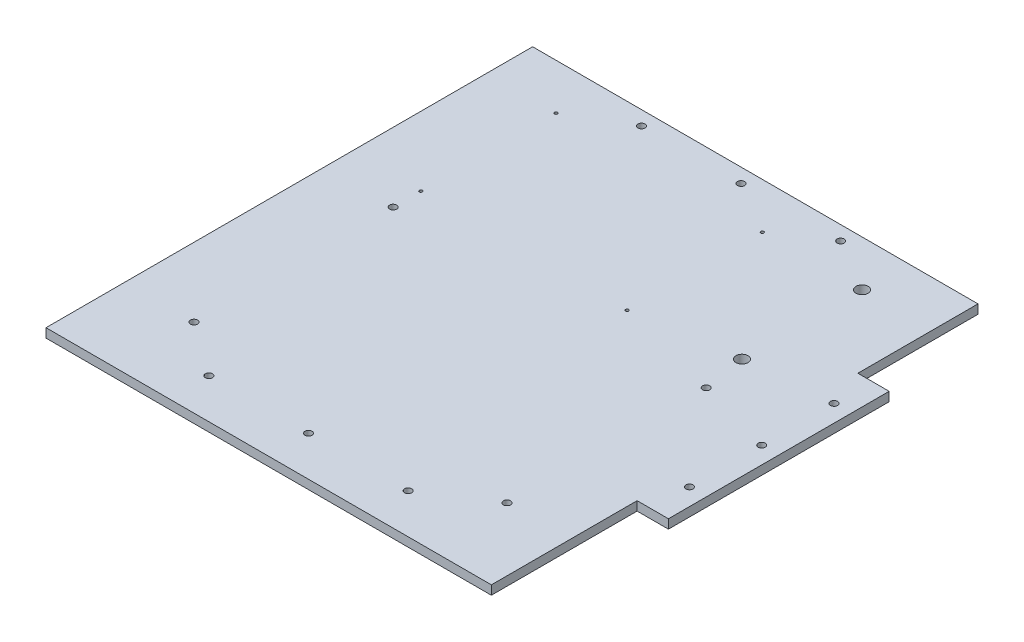
ISO-10303-21;
HEADER;
FILE_DESCRIPTION(('STEP AP214'),'2;1');
FILE_NAME('part.step','',(''),(''),'','','');
FILE_SCHEMA(('AUTOMOTIVE_DESIGN { 1 0 10303 214 1 1 1 1 }'));
ENDSEC;
DATA;
#1=APPLICATION_CONTEXT('core data for automotive mechanical design processes');
#2=APPLICATION_PROTOCOL_DEFINITION('international standard','automotive_design',2000,#1);
#3=PRODUCT_CONTEXT('',#1,'mechanical');
#4=PRODUCT('Part','Part','',(#3));
#5=PRODUCT_RELATED_PRODUCT_CATEGORY('part','',(#4));
#6=PRODUCT_DEFINITION_FORMATION('','',#4);
#7=PRODUCT_DEFINITION_CONTEXT('part definition',#1,'design');
#8=PRODUCT_DEFINITION('design','',#6,#7);
#9=PRODUCT_DEFINITION_SHAPE('','',#8);
#10=(LENGTH_UNIT() NAMED_UNIT(*) SI_UNIT(.MILLI.,.METRE.));
#11=(NAMED_UNIT(*) PLANE_ANGLE_UNIT() SI_UNIT($,.RADIAN.));
#12=(NAMED_UNIT(*) SI_UNIT($,.STERADIAN.) SOLID_ANGLE_UNIT());
#13=UNCERTAINTY_MEASURE_WITH_UNIT(LENGTH_MEASURE(1.E-05),#10,'distance_accuracy_value','');
#14=(GEOMETRIC_REPRESENTATION_CONTEXT(3) GLOBAL_UNCERTAINTY_ASSIGNED_CONTEXT((#13)) GLOBAL_UNIT_ASSIGNED_CONTEXT((#10,
#11,#12)) REPRESENTATION_CONTEXT('',''));
#15=CARTESIAN_POINT('',(0.,0.,0.));
#16=DIRECTION('',(0.,0.,1.));
#17=DIRECTION('',(1.,0.,0.));
#18=AXIS2_PLACEMENT_3D('',#15,#16,#17);
#19=CARTESIAN_POINT('',(156.499999999998,-6.35,171.));
#20=DIRECTION('',(1.,0.,0.));
#21=DIRECTION('',(0.,0.,-1.));
#22=AXIS2_PLACEMENT_3D('',#19,#20,#21);
#23=PLANE('',#22);
#24=DIRECTION('',(0.,0.,-1.));
#25=VECTOR('',#24,1.);
#26=CARTESIAN_POINT('',(156.499999999998,-6.35,171.));
#27=LINE('',#26,#25);
#28=CARTESIAN_POINT('',(156.499999999998,-6.35,171.));
#29=VERTEX_POINT('',#28);
#30=CARTESIAN_POINT('',(156.499999999998,-6.35,68.570201764885));
#31=VERTEX_POINT('',#30);
#32=EDGE_CURVE('E148',#29,#31,#27,.T.);
#33=ORIENTED_EDGE('',*,*,#32,.T.);
#34=DIRECTION('',(0.,1.,0.));
#35=VECTOR('',#34,1.);
#36=CARTESIAN_POINT('',(156.499999999998,-6.35,68.570201764885));
#37=LINE('',#36,#35);
#38=CARTESIAN_POINT('',(156.499999999998,0.,68.570201764885));
#39=VERTEX_POINT('',#38);
#40=EDGE_CURVE('E130',#31,#39,#37,.T.);
#41=ORIENTED_EDGE('',*,*,#40,.T.);
#42=DIRECTION('',(0.,0.,-1.));
#43=VECTOR('',#42,1.);
#44=CARTESIAN_POINT('',(156.499999999998,0.,171.));
#45=LINE('',#44,#43);
#46=CARTESIAN_POINT('',(156.499999999998,0.,171.));
#47=VERTEX_POINT('',#46);
#48=EDGE_CURVE('E158',#47,#39,#45,.T.);
#49=ORIENTED_EDGE('',*,*,#48,.F.);
#50=DIRECTION('',(0.,1.,0.));
#51=VECTOR('',#50,1.);
#52=CARTESIAN_POINT('',(156.499999999998,-6.35,171.));
#53=LINE('',#52,#51);
#54=EDGE_CURVE('E11',#29,#47,#53,.T.);
#55=ORIENTED_EDGE('',*,*,#54,.F.);
#56=EDGE_LOOP('',(#33,#41,#49,#55));
#57=FACE_BOUND('',#56,.T.);
#58=ADVANCED_FACE('F37',(#57),#23,.T.);
#59=DIRECTION('',(0.,1.,0.));
#60=VECTOR('',#59,1.);
#61=CARTESIAN_POINT('',(156.499999999998,-6.35,-86.570201764878));
#62=LINE('',#61,#60);
#63=CARTESIAN_POINT('',(156.499999999998,-6.35,-86.570201764878));
#64=VERTEX_POINT('',#63);
#65=CARTESIAN_POINT('',(156.499999999998,0.,-86.570201764878));
#66=VERTEX_POINT('',#65);
#67=EDGE_CURVE('E145',#64,#66,#62,.T.);
#68=ORIENTED_EDGE('',*,*,#67,.F.);
#69=CARTESIAN_POINT('',(156.499999999998,-6.35,-171.));
#70=VERTEX_POINT('',#69);
#71=EDGE_CURVE('E88',#64,#70,#27,.T.);
#72=ORIENTED_EDGE('',*,*,#71,.T.);
#73=DIRECTION('',(0.,1.,0.));
#74=VECTOR('',#73,1.);
#75=CARTESIAN_POINT('',(156.499999999998,-6.35,-171.));
#76=LINE('',#75,#74);
#77=CARTESIAN_POINT('',(156.499999999998,0.,-171.));
#78=VERTEX_POINT('',#77);
#79=EDGE_CURVE('E41',#70,#78,#76,.T.);
#80=ORIENTED_EDGE('',*,*,#79,.T.);
#81=EDGE_CURVE('E144',#66,#78,#45,.T.);
#82=ORIENTED_EDGE('',*,*,#81,.F.);
#83=EDGE_LOOP('',(#68,#72,#80,#82));
#84=FACE_BOUND('',#83,.T.);
#85=ADVANCED_FACE('F39',(#84),#23,.T.);
#86=CARTESIAN_POINT('',(-156.500000000002,-6.35,171.));
#87=DIRECTION('',(0.,0.,1.));
#88=DIRECTION('',(1.,0.,0.));
#89=AXIS2_PLACEMENT_3D('',#86,#87,#88);
#90=PLANE('',#89);
#91=DIRECTION('',(1.,0.,0.));
#92=VECTOR('',#91,1.);
#93=CARTESIAN_POINT('',(-156.500000000002,0.,171.));
#94=LINE('',#93,#92);
#95=CARTESIAN_POINT('',(-156.500000000002,0.,171.));
#96=VERTEX_POINT('',#95);
#97=EDGE_CURVE('E167',#96,#47,#94,.T.);
#98=ORIENTED_EDGE('',*,*,#97,.F.);
#99=DIRECTION('',(0.,1.,0.));
#100=VECTOR('',#99,1.);
#101=CARTESIAN_POINT('',(-156.500000000002,-6.35,171.));
#102=LINE('',#101,#100);
#103=CARTESIAN_POINT('',(-156.500000000002,-6.35,171.));
#104=VERTEX_POINT('',#103);
#105=EDGE_CURVE('E46',#104,#96,#102,.T.);
#106=ORIENTED_EDGE('',*,*,#105,.F.);
#107=DIRECTION('',(1.,0.,0.));
#108=VECTOR('',#107,1.);
#109=CARTESIAN_POINT('',(-156.500000000002,-6.35,171.));
#110=LINE('',#109,#108);
#111=EDGE_CURVE('E156',#104,#29,#110,.T.);
#112=ORIENTED_EDGE('',*,*,#111,.T.);
#113=ORIENTED_EDGE('',*,*,#54,.T.);
#114=EDGE_LOOP('',(#98,#106,#112,#113));
#115=FACE_BOUND('',#114,.T.);
#116=ADVANCED_FACE('F187',(#115),#90,.T.);
#117=CARTESIAN_POINT('',(-156.500000000002,-6.35,171.));
#118=DIRECTION('',(-1.,0.,0.));
#119=DIRECTION('',(0.,0.,1.));
#120=AXIS2_PLACEMENT_3D('',#117,#118,#119);
#121=PLANE('',#120);
#122=DIRECTION('',(0.,0.,1.));
#123=VECTOR('',#122,1.);
#124=CARTESIAN_POINT('',(-156.500000000002,0.,171.));
#125=LINE('',#124,#123);
#126=CARTESIAN_POINT('',(-156.500000000002,0.,-171.));
#127=VERTEX_POINT('',#126);
#128=EDGE_CURVE('E164',#127,#96,#125,.T.);
#129=ORIENTED_EDGE('',*,*,#128,.F.);
#130=DIRECTION('',(0.,1.,0.));
#131=VECTOR('',#130,1.);
#132=CARTESIAN_POINT('',(-156.500000000002,-6.35,-171.));
#133=LINE('',#132,#131);
#134=CARTESIAN_POINT('',(-156.500000000002,-6.35,-171.));
#135=VERTEX_POINT('',#134);
#136=EDGE_CURVE('E170',#135,#127,#133,.T.);
#137=ORIENTED_EDGE('',*,*,#136,.F.);
#138=DIRECTION('',(0.,0.,1.));
#139=VECTOR('',#138,1.);
#140=CARTESIAN_POINT('',(-156.500000000002,-6.35,171.));
#141=LINE('',#140,#139);
#142=EDGE_CURVE('E153',#135,#104,#141,.T.);
#143=ORIENTED_EDGE('',*,*,#142,.T.);
#144=ORIENTED_EDGE('',*,*,#105,.T.);
#145=EDGE_LOOP('',(#129,#137,#143,#144));
#146=FACE_BOUND('',#145,.T.);
#147=ADVANCED_FACE('F186',(#146),#121,.T.);
#148=CARTESIAN_POINT('',(-156.500000000002,-6.35,-171.));
#149=DIRECTION('',(0.,0.,-1.));
#150=DIRECTION('',(-1.,0.,0.));
#151=AXIS2_PLACEMENT_3D('',#148,#149,#150);
#152=PLANE('',#151);
#153=DIRECTION('',(-1.,0.,0.));
#154=VECTOR('',#153,1.);
#155=CARTESIAN_POINT('',(-156.500000000002,0.,-171.));
#156=LINE('',#155,#154);
#157=EDGE_CURVE('E161',#78,#127,#156,.T.);
#158=ORIENTED_EDGE('',*,*,#157,.F.);
#159=ORIENTED_EDGE('',*,*,#79,.F.);
#160=DIRECTION('',(-1.,0.,0.));
#161=VECTOR('',#160,1.);
#162=CARTESIAN_POINT('',(-156.500000000002,-6.35,-171.));
#163=LINE('',#162,#161);
#164=EDGE_CURVE('E150',#70,#135,#163,.T.);
#165=ORIENTED_EDGE('',*,*,#164,.T.);
#166=ORIENTED_EDGE('',*,*,#136,.T.);
#167=EDGE_LOOP('',(#158,#159,#165,#166));
#168=FACE_BOUND('',#167,.T.);
#169=ADVANCED_FACE('F176',(#168),#152,.T.);
#170=CARTESIAN_POINT('',(0.,-6.35,0.));
#171=DIRECTION('',(0.,-1.,0.));
#172=DIRECTION('',(0.,0.,-1.));
#173=AXIS2_PLACEMENT_3D('',#170,#171,#172);
#174=PLANE('',#173);
#175=CARTESIAN_POINT('',(107.20488213636,-6.35,-54.4253878544765));
#176=DIRECTION('',(0.,1.,0.));
#177=DIRECTION('',(0.,0.,1.));
#178=AXIS2_PLACEMENT_3D('',#175,#176,#177);
#179=CIRCLE('',#178,4.25000000000002);
#180=CARTESIAN_POINT('',(107.20488213636,-6.35,-50.1753878544765));
#181=VERTEX_POINT('',#180);
#182=EDGE_CURVE('E326',#181,#181,#179,.T.);
#183=ORIENTED_EDGE('',*,*,#182,.T.);
#184=EDGE_LOOP('',(#183));
#185=FACE_BOUND('',#184,.T.);
#186=CARTESIAN_POINT('',(-107.911484213623,-6.35,115.605535397188));
#187=DIRECTION('',(0.,1.,0.));
#188=DIRECTION('',(0.,0.,-1.));
#189=AXIS2_PLACEMENT_3D('',#186,#187,#188);
#190=CIRCLE('',#189,2.50000000000005);
#191=CARTESIAN_POINT('',(-107.911484213623,-6.35,113.105535397188));
#192=VERTEX_POINT('',#191);
#193=EDGE_CURVE('E316',#192,#192,#190,.T.);
#194=ORIENTED_EDGE('',*,*,#193,.T.);
#195=EDGE_LOOP('',(#194));
#196=FACE_BOUND('',#195,.T.);
#197=CARTESIAN_POINT('',(-107.911484213622,-6.35,-24.3944646028125));
#198=DIRECTION('',(0.,1.,0.));
#199=DIRECTION('',(0.,0.,-1.));
#200=AXIS2_PLACEMENT_3D('',#197,#198,#199);
#201=CIRCLE('',#200,2.50000000000005);
#202=CARTESIAN_POINT('',(-107.911484213622,-6.35,-26.8944646028126));
#203=VERTEX_POINT('',#202);
#204=EDGE_CURVE('E317',#203,#203,#201,.T.);
#205=ORIENTED_EDGE('',*,*,#204,.T.);
#206=EDGE_LOOP('',(#205));
#207=FACE_BOUND('',#206,.T.);
#208=CARTESIAN_POINT('',(112.088515786378,-6.35,-24.394464602811));
#209=DIRECTION('',(0.,1.,0.));
#210=DIRECTION('',(0.,0.,-1.));
#211=AXIS2_PLACEMENT_3D('',#208,#209,#210);
#212=CIRCLE('',#211,2.49999999999997);
#213=CARTESIAN_POINT('',(112.088515786378,-6.35,-26.8944646028109));
#214=VERTEX_POINT('',#213);
#215=EDGE_CURVE('E306',#214,#214,#212,.T.);
#216=ORIENTED_EDGE('',*,*,#215,.T.);
#217=EDGE_LOOP('',(#216));
#218=FACE_BOUND('',#217,.T.);
#219=CARTESIAN_POINT('',(37.0885157863766,-6.35,-138.829587854477));
#220=DIRECTION('',(0.,1.,0.));
#221=DIRECTION('',(0.,0.,1.));
#222=AXIS2_PLACEMENT_3D('',#219,#220,#221);
#223=CIRCLE('',#222,1.04999999999979);
#224=CARTESIAN_POINT('',(37.0885157863766,-6.35,-137.779587854477));
#225=VERTEX_POINT('',#224);
#226=EDGE_CURVE('E349',#225,#225,#223,.T.);
#227=ORIENTED_EDGE('',*,*,#226,.T.);
#228=EDGE_LOOP('',(#227));
#229=FACE_BOUND('',#228,.T.);
#230=CARTESIAN_POINT('',(37.0885157863766,-6.35,-43.8295878544765));
#231=DIRECTION('',(0.,1.,0.));
#232=DIRECTION('',(0.,0.,1.));
#233=AXIS2_PLACEMENT_3D('',#230,#231,#232);
#234=CIRCLE('',#233,1.05000000000002);
#235=CARTESIAN_POINT('',(37.0885157863766,-6.35,-42.7795878544765));
#236=VERTEX_POINT('',#235);
#237=EDGE_CURVE('E336',#236,#236,#234,.T.);
#238=ORIENTED_EDGE('',*,*,#237,.T.);
#239=EDGE_LOOP('',(#238));
#240=FACE_BOUND('',#239,.T.);
#241=CARTESIAN_POINT('',(-107.911484213623,-6.35,-43.8295878544765));
#242=DIRECTION('',(0.,1.,0.));
#243=DIRECTION('',(0.,0.,1.));
#244=AXIS2_PLACEMENT_3D('',#241,#242,#243);
#245=CIRCLE('',#244,1.04999999999999);
#246=CARTESIAN_POINT('',(-107.911484213623,-6.35,-42.7795878544765));
#247=VERTEX_POINT('',#246);
#248=EDGE_CURVE('E337',#247,#247,#245,.T.);
#249=ORIENTED_EDGE('',*,*,#248,.T.);
#250=EDGE_LOOP('',(#249));
#251=FACE_BOUND('',#250,.T.);
#252=CARTESIAN_POINT('',(107.20488213636,-6.35,-138.829587854477));
#253=DIRECTION('',(0.,1.,0.));
#254=DIRECTION('',(0.,0.,-1.));
#255=AXIS2_PLACEMENT_3D('',#252,#253,#254);
#256=CIRCLE('',#255,4.25000000000001);
#257=CARTESIAN_POINT('',(107.20488213636,-6.35,-143.079587854477));
#258=VERTEX_POINT('',#257);
#259=EDGE_CURVE('E325',#258,#258,#256,.T.);
#260=ORIENTED_EDGE('',*,*,#259,.T.);
#261=EDGE_LOOP('',(#260));
#262=FACE_BOUND('',#261,.T.);
#263=CARTESIAN_POINT('',(112.088515786377,-6.35,115.60553539719));
#264=DIRECTION('',(0.,1.,0.));
#265=DIRECTION('',(0.,0.,-1.));
#266=AXIS2_PLACEMENT_3D('',#263,#264,#265);
#267=CIRCLE('',#266,2.49999999999995);
#268=CARTESIAN_POINT('',(112.088515786377,-6.35,113.10553539719));
#269=VERTEX_POINT('',#268);
#270=EDGE_CURVE('E301',#269,#269,#267,.T.);
#271=ORIENTED_EDGE('',*,*,#270,.T.);
#272=EDGE_LOOP('',(#271));
#273=FACE_BOUND('',#272,.T.);
#274=CARTESIAN_POINT('',(-107.911484213623,-6.35,-138.829587854477));
#275=DIRECTION('',(0.,1.,0.));
#276=DIRECTION('',(0.,0.,1.));
#277=AXIS2_PLACEMENT_3D('',#274,#275,#276);
#278=CIRCLE('',#277,1.05000000000002);
#279=CARTESIAN_POINT('',(-107.911484213623,-6.35,-137.779587854476));
#280=VERTEX_POINT('',#279);
#281=EDGE_CURVE('E357',#280,#280,#278,.T.);
#282=ORIENTED_EDGE('',*,*,#281,.T.);
#283=EDGE_LOOP('',(#282));
#284=FACE_BOUND('',#283,.T.);
#285=CARTESIAN_POINT('',(-70.,-6.35,143.000000000004));
#286=DIRECTION('',(0.,1.,0.));
#287=DIRECTION('',(0.,0.,1.));
#288=AXIS2_PLACEMENT_3D('',#285,#286,#287);
#289=CIRCLE('',#288,2.5);
#290=CARTESIAN_POINT('',(-70.,-6.35,145.500000000004));
#291=VERTEX_POINT('',#290);
#292=EDGE_CURVE('E373',#291,#291,#289,.T.);
#293=ORIENTED_EDGE('',*,*,#292,.T.);
#294=EDGE_LOOP('',(#293));
#295=FACE_BOUND('',#294,.T.);
#296=CARTESIAN_POINT('',(70.,-6.35,143.000000000004));
#297=DIRECTION('',(0.,1.,0.));
#298=DIRECTION('',(0.,0.,-1.));
#299=AXIS2_PLACEMENT_3D('',#296,#297,#298);
#300=CIRCLE('',#299,2.5);
#301=CARTESIAN_POINT('',(70.,-6.35,140.500000000004));
#302=VERTEX_POINT('',#301);
#303=EDGE_CURVE('E379',#302,#302,#300,.T.);
#304=ORIENTED_EDGE('',*,*,#303,.T.);
#305=EDGE_LOOP('',(#304));
#306=FACE_BOUND('',#305,.T.);
#307=CARTESIAN_POINT('',(-70.,-6.35,-160.999999999996));
#308=DIRECTION('',(0.,1.,0.));
#309=DIRECTION('',(0.,0.,-1.));
#310=AXIS2_PLACEMENT_3D('',#307,#308,#309);
#311=CIRCLE('',#310,2.50000000000001);
#312=CARTESIAN_POINT('',(-70.,-6.35,-163.499999999996));
#313=VERTEX_POINT('',#312);
#314=EDGE_CURVE('E385',#313,#313,#311,.T.);
#315=ORIENTED_EDGE('',*,*,#314,.T.);
#316=EDGE_LOOP('',(#315));
#317=FACE_BOUND('',#316,.T.);
#318=CARTESIAN_POINT('',(0.,-6.35,-160.999999999996));
#319=DIRECTION('',(0.,1.,0.));
#320=DIRECTION('',(0.,0.,-1.));
#321=AXIS2_PLACEMENT_3D('',#318,#319,#320);
#322=CIRCLE('',#321,2.49999999999999);
#323=CARTESIAN_POINT('',(0.,-6.35,-163.499999999996));
#324=VERTEX_POINT('',#323);
#325=EDGE_CURVE('E366',#324,#324,#322,.T.);
#326=ORIENTED_EDGE('',*,*,#325,.T.);
#327=EDGE_LOOP('',(#326));
#328=FACE_BOUND('',#327,.T.);
#329=CARTESIAN_POINT('',(70.,-6.35,-160.999999999996));
#330=DIRECTION('',(0.,1.,0.));
#331=DIRECTION('',(0.,0.,1.));
#332=AXIS2_PLACEMENT_3D('',#329,#330,#331);
#333=CIRCLE('',#332,2.50000000000001);
#334=CARTESIAN_POINT('',(70.,-6.35,-158.499999999996));
#335=VERTEX_POINT('',#334);
#336=EDGE_CURVE('E360',#335,#335,#333,.T.);
#337=ORIENTED_EDGE('',*,*,#336,.T.);
#338=EDGE_LOOP('',(#337));
#339=FACE_BOUND('',#338,.T.);
#340=CARTESIAN_POINT('',(0.,-6.35,143.000000000004));
#341=DIRECTION('',(0.,1.,0.));
#342=DIRECTION('',(0.,0.,1.));
#343=AXIS2_PLACEMENT_3D('',#340,#341,#342);
#344=CIRCLE('',#343,2.5);
#345=CARTESIAN_POINT('',(0.,-6.35,145.500000000004));
#346=VERTEX_POINT('',#345);
#347=EDGE_CURVE('E393',#346,#346,#344,.T.);
#348=ORIENTED_EDGE('',*,*,#347,.T.);
#349=EDGE_LOOP('',(#348));
#350=FACE_BOUND('',#349,.T.);
#351=ORIENTED_EDGE('',*,*,#32,.F.);
#352=ORIENTED_EDGE('',*,*,#111,.F.);
#353=ORIENTED_EDGE('',*,*,#142,.F.);
#354=ORIENTED_EDGE('',*,*,#164,.F.);
#355=ORIENTED_EDGE('',*,*,#71,.F.);
#356=DIRECTION('',(-1.,0.,0.));
#357=VECTOR('',#356,1.);
#358=CARTESIAN_POINT('',(178.499999999998,-6.35,-86.570201764878));
#359=LINE('',#358,#357);
#360=CARTESIAN_POINT('',(178.499999999998,-6.35,-86.570201764878));
#361=VERTEX_POINT('',#360);
#362=EDGE_CURVE('E120',#361,#64,#359,.T.);
#363=ORIENTED_EDGE('',*,*,#362,.F.);
#364=DIRECTION('',(0.,0.,-1.));
#365=VECTOR('',#364,1.);
#366=CARTESIAN_POINT('',(178.499999999998,-6.35,68.570201764885));
#367=LINE('',#366,#365);
#368=CARTESIAN_POINT('',(178.499999999998,-6.35,68.570201764885));
#369=VERTEX_POINT('',#368);
#370=EDGE_CURVE('E115',#369,#361,#367,.T.);
#371=ORIENTED_EDGE('',*,*,#370,.F.);
#372=DIRECTION('',(1.,0.,0.));
#373=VECTOR('',#372,1.);
#374=CARTESIAN_POINT('',(156.499999999998,-6.35,68.570201764885));
#375=LINE('',#374,#373);
#376=EDGE_CURVE('E127',#31,#369,#375,.T.);
#377=ORIENTED_EDGE('',*,*,#376,.F.);
#378=EDGE_LOOP('',(#351,#352,#353,#354,#355,#363,#371,#377));
#379=FACE_BOUND('',#378,.T.);
#380=CARTESIAN_POINT('',(166.499999999998,-6.35,-59.7999999999965));
#381=DIRECTION('',(0.,1.,0.));
#382=DIRECTION('',(0.,0.,-1.));
#383=AXIS2_PLACEMENT_3D('',#380,#381,#382);
#384=CIRCLE('',#383,2.5);
#385=CARTESIAN_POINT('',(166.499999999998,-6.35,-62.2999999999965));
#386=VERTEX_POINT('',#385);
#387=EDGE_CURVE('E399',#386,#386,#384,.T.);
#388=ORIENTED_EDGE('',*,*,#387,.T.);
#389=EDGE_LOOP('',(#388));
#390=FACE_BOUND('',#389,.T.);
#391=CARTESIAN_POINT('',(166.499999999998,-6.35,41.8000000000035));
#392=DIRECTION('',(0.,1.,0.));
#393=DIRECTION('',(0.,0.,1.));
#394=AXIS2_PLACEMENT_3D('',#391,#392,#393);
#395=CIRCLE('',#394,2.5);
#396=CARTESIAN_POINT('',(166.499999999998,-6.35,44.3000000000035));
#397=VERTEX_POINT('',#396);
#398=EDGE_CURVE('E405',#397,#397,#395,.T.);
#399=ORIENTED_EDGE('',*,*,#398,.T.);
#400=EDGE_LOOP('',(#399));
#401=FACE_BOUND('',#400,.T.);
#402=CARTESIAN_POINT('',(166.499999999998,-6.35,-8.99999999999648));
#403=DIRECTION('',(0.,1.,0.));
#404=DIRECTION('',(0.,0.,1.));
#405=AXIS2_PLACEMENT_3D('',#402,#403,#404);
#406=CIRCLE('',#405,2.5);
#407=CARTESIAN_POINT('',(166.499999999998,-6.35,-6.49999999999649));
#408=VERTEX_POINT('',#407);
#409=EDGE_CURVE('E141',#408,#408,#406,.T.);
#410=ORIENTED_EDGE('',*,*,#409,.T.);
#411=EDGE_LOOP('',(#410));
#412=FACE_BOUND('',#411,.T.);
#413=ADVANCED_FACE('F125',(#185,#196,#207,#218,#229,#240,#251,#262,#273,#284,#295,#306,#317,
#328,#339,#350,#379,#390,#401,#412),#174,.T.);
#414=CARTESIAN_POINT('',(0.,0.,0.));
#415=DIRECTION('',(0.,-1.,0.));
#416=DIRECTION('',(0.,0.,-1.));
#417=AXIS2_PLACEMENT_3D('',#414,#415,#416);
#418=PLANE('',#417);
#419=CARTESIAN_POINT('',(107.20488213636,0.,-54.4253878544765));
#420=DIRECTION('',(0.,1.,0.));
#421=DIRECTION('',(0.,0.,1.));
#422=AXIS2_PLACEMENT_3D('',#419,#420,#421);
#423=CIRCLE('',#422,4.25000000000002);
#424=CARTESIAN_POINT('',(107.20488213636,0.,-50.1753878544765));
#425=VERTEX_POINT('',#424);
#426=EDGE_CURVE('E322',#425,#425,#423,.T.);
#427=ORIENTED_EDGE('',*,*,#426,.F.);
#428=EDGE_LOOP('',(#427));
#429=FACE_BOUND('',#428,.T.);
#430=CARTESIAN_POINT('',(-107.911484213623,0.,115.605535397188));
#431=DIRECTION('',(0.,1.,0.));
#432=DIRECTION('',(0.,0.,-1.));
#433=AXIS2_PLACEMENT_3D('',#430,#431,#432);
#434=CIRCLE('',#433,2.50000000000005);
#435=CARTESIAN_POINT('',(-107.911484213623,0.,113.105535397188));
#436=VERTEX_POINT('',#435);
#437=EDGE_CURVE('E328',#436,#436,#434,.T.);
#438=ORIENTED_EDGE('',*,*,#437,.F.);
#439=EDGE_LOOP('',(#438));
#440=FACE_BOUND('',#439,.T.);
#441=CARTESIAN_POINT('',(-107.911484213622,0.,-24.3944646028125));
#442=DIRECTION('',(0.,1.,0.));
#443=DIRECTION('',(0.,0.,-1.));
#444=AXIS2_PLACEMENT_3D('',#441,#442,#443);
#445=CIRCLE('',#444,2.50000000000005);
#446=CARTESIAN_POINT('',(-107.911484213622,0.,-26.8944646028126));
#447=VERTEX_POINT('',#446);
#448=EDGE_CURVE('E313',#447,#447,#445,.T.);
#449=ORIENTED_EDGE('',*,*,#448,.F.);
#450=EDGE_LOOP('',(#449));
#451=FACE_BOUND('',#450,.T.);
#452=CARTESIAN_POINT('',(112.088515786378,0.,-24.394464602811));
#453=DIRECTION('',(0.,1.,0.));
#454=DIRECTION('',(0.,0.,-1.));
#455=AXIS2_PLACEMENT_3D('',#452,#453,#454);
#456=CIRCLE('',#455,2.49999999999997);
#457=CARTESIAN_POINT('',(112.088515786378,0.,-26.8944646028109));
#458=VERTEX_POINT('',#457);
#459=EDGE_CURVE('E309',#458,#458,#456,.T.);
#460=ORIENTED_EDGE('',*,*,#459,.F.);
#461=EDGE_LOOP('',(#460));
#462=FACE_BOUND('',#461,.T.);
#463=CARTESIAN_POINT('',(37.0885157863766,0.,-138.829587854477));
#464=DIRECTION('',(0.,1.,0.));
#465=DIRECTION('',(0.,0.,1.));
#466=AXIS2_PLACEMENT_3D('',#463,#464,#465);
#467=CIRCLE('',#466,1.04999999999979);
#468=CARTESIAN_POINT('',(37.0885157863766,0.,-137.779587854477));
#469=VERTEX_POINT('',#468);
#470=EDGE_CURVE('E345',#469,#469,#467,.T.);
#471=ORIENTED_EDGE('',*,*,#470,.F.);
#472=EDGE_LOOP('',(#471));
#473=FACE_BOUND('',#472,.T.);
#474=CARTESIAN_POINT('',(37.0885157863766,0.,-43.8295878544765));
#475=DIRECTION('',(0.,1.,0.));
#476=DIRECTION('',(0.,0.,1.));
#477=AXIS2_PLACEMENT_3D('',#474,#475,#476);
#478=CIRCLE('',#477,1.05000000000002);
#479=CARTESIAN_POINT('',(37.0885157863766,0.,-42.7795878544765));
#480=VERTEX_POINT('',#479);
#481=EDGE_CURVE('E352',#480,#480,#478,.T.);
#482=ORIENTED_EDGE('',*,*,#481,.F.);
#483=EDGE_LOOP('',(#482));
#484=FACE_BOUND('',#483,.T.);
#485=CARTESIAN_POINT('',(-107.911484213623,0.,-43.8295878544765));
#486=DIRECTION('',(0.,1.,0.));
#487=DIRECTION('',(0.,0.,1.));
#488=AXIS2_PLACEMENT_3D('',#485,#486,#487);
#489=CIRCLE('',#488,1.04999999999999);
#490=CARTESIAN_POINT('',(-107.911484213623,0.,-42.7795878544765));
#491=VERTEX_POINT('',#490);
#492=EDGE_CURVE('E333',#491,#491,#489,.T.);
#493=ORIENTED_EDGE('',*,*,#492,.F.);
#494=EDGE_LOOP('',(#493));
#495=FACE_BOUND('',#494,.T.);
#496=CARTESIAN_POINT('',(107.20488213636,0.,-138.829587854477));
#497=DIRECTION('',(0.,1.,0.));
#498=DIRECTION('',(0.,0.,-1.));
#499=AXIS2_PLACEMENT_3D('',#496,#497,#498);
#500=CIRCLE('',#499,4.25000000000001);
#501=CARTESIAN_POINT('',(107.20488213636,0.,-143.079587854477));
#502=VERTEX_POINT('',#501);
#503=EDGE_CURVE('E340',#502,#502,#500,.T.);
#504=ORIENTED_EDGE('',*,*,#503,.F.);
#505=EDGE_LOOP('',(#504));
#506=FACE_BOUND('',#505,.T.);
#507=CARTESIAN_POINT('',(112.088515786377,0.,115.60553539719));
#508=DIRECTION('',(0.,1.,0.));
#509=DIRECTION('',(0.,0.,-1.));
#510=AXIS2_PLACEMENT_3D('',#507,#508,#509);
#511=CIRCLE('',#510,2.49999999999995);
#512=CARTESIAN_POINT('',(112.088515786377,0.,113.10553539719));
#513=VERTEX_POINT('',#512);
#514=EDGE_CURVE('E304',#513,#513,#511,.T.);
#515=ORIENTED_EDGE('',*,*,#514,.F.);
#516=EDGE_LOOP('',(#515));
#517=FACE_BOUND('',#516,.T.);
#518=CARTESIAN_POINT('',(-107.911484213623,0.,-138.829587854477));
#519=DIRECTION('',(0.,1.,0.));
#520=DIRECTION('',(0.,0.,1.));
#521=AXIS2_PLACEMENT_3D('',#518,#519,#520);
#522=CIRCLE('',#521,1.05000000000002);
#523=CARTESIAN_POINT('',(-107.911484213623,0.,-137.779587854476));
#524=VERTEX_POINT('',#523);
#525=EDGE_CURVE('E348',#524,#524,#522,.T.);
#526=ORIENTED_EDGE('',*,*,#525,.F.);
#527=EDGE_LOOP('',(#526));
#528=FACE_BOUND('',#527,.T.);
#529=CARTESIAN_POINT('',(-70.,0.,143.000000000004));
#530=DIRECTION('',(0.,1.,0.));
#531=DIRECTION('',(0.,0.,1.));
#532=AXIS2_PLACEMENT_3D('',#529,#530,#531);
#533=CIRCLE('',#532,2.5);
#534=CARTESIAN_POINT('',(-70.,0.,145.500000000004));
#535=VERTEX_POINT('',#534);
#536=EDGE_CURVE('E369',#535,#535,#533,.T.);
#537=ORIENTED_EDGE('',*,*,#536,.F.);
#538=EDGE_LOOP('',(#537));
#539=FACE_BOUND('',#538,.T.);
#540=CARTESIAN_POINT('',(70.,0.,143.000000000004));
#541=DIRECTION('',(0.,1.,0.));
#542=DIRECTION('',(0.,0.,-1.));
#543=AXIS2_PLACEMENT_3D('',#540,#541,#542);
#544=CIRCLE('',#543,2.5);
#545=CARTESIAN_POINT('',(70.,0.,140.500000000004));
#546=VERTEX_POINT('',#545);
#547=EDGE_CURVE('E376',#546,#546,#544,.T.);
#548=ORIENTED_EDGE('',*,*,#547,.F.);
#549=EDGE_LOOP('',(#548));
#550=FACE_BOUND('',#549,.T.);
#551=CARTESIAN_POINT('',(-70.,0.,-160.999999999996));
#552=DIRECTION('',(0.,1.,0.));
#553=DIRECTION('',(0.,0.,-1.));
#554=AXIS2_PLACEMENT_3D('',#551,#552,#553);
#555=CIRCLE('',#554,2.50000000000001);
#556=CARTESIAN_POINT('',(-70.,0.,-163.499999999996));
#557=VERTEX_POINT('',#556);
#558=EDGE_CURVE('E382',#557,#557,#555,.T.);
#559=ORIENTED_EDGE('',*,*,#558,.F.);
#560=EDGE_LOOP('',(#559));
#561=FACE_BOUND('',#560,.T.);
#562=CARTESIAN_POINT('',(0.,0.,-160.999999999996));
#563=DIRECTION('',(0.,1.,0.));
#564=DIRECTION('',(0.,0.,-1.));
#565=AXIS2_PLACEMENT_3D('',#562,#563,#564);
#566=CIRCLE('',#565,2.49999999999999);
#567=CARTESIAN_POINT('',(0.,0.,-163.499999999996));
#568=VERTEX_POINT('',#567);
#569=EDGE_CURVE('E388',#568,#568,#566,.T.);
#570=ORIENTED_EDGE('',*,*,#569,.F.);
#571=EDGE_LOOP('',(#570));
#572=FACE_BOUND('',#571,.T.);
#573=CARTESIAN_POINT('',(70.,0.,-160.999999999996));
#574=DIRECTION('',(0.,1.,0.));
#575=DIRECTION('',(0.,0.,1.));
#576=AXIS2_PLACEMENT_3D('',#573,#574,#575);
#577=CIRCLE('',#576,2.50000000000001);
#578=CARTESIAN_POINT('',(70.,0.,-158.499999999996));
#579=VERTEX_POINT('',#578);
#580=EDGE_CURVE('E363',#579,#579,#577,.T.);
#581=ORIENTED_EDGE('',*,*,#580,.F.);
#582=EDGE_LOOP('',(#581));
#583=FACE_BOUND('',#582,.T.);
#584=CARTESIAN_POINT('',(0.,0.,143.000000000004));
#585=DIRECTION('',(0.,1.,0.));
#586=DIRECTION('',(0.,0.,1.));
#587=AXIS2_PLACEMENT_3D('',#584,#585,#586);
#588=CIRCLE('',#587,2.5);
#589=CARTESIAN_POINT('',(0.,0.,145.500000000004));
#590=VERTEX_POINT('',#589);
#591=EDGE_CURVE('E372',#590,#590,#588,.T.);
#592=ORIENTED_EDGE('',*,*,#591,.F.);
#593=EDGE_LOOP('',(#592));
#594=FACE_BOUND('',#593,.T.);
#595=ORIENTED_EDGE('',*,*,#48,.T.);
#596=DIRECTION('',(1.,0.,0.));
#597=VECTOR('',#596,1.);
#598=CARTESIAN_POINT('',(156.499999999998,0.,68.570201764885));
#599=LINE('',#598,#597);
#600=CARTESIAN_POINT('',(178.499999999998,0.,68.570201764885));
#601=VERTEX_POINT('',#600);
#602=EDGE_CURVE('E54',#39,#601,#599,.T.);
#603=ORIENTED_EDGE('',*,*,#602,.T.);
#604=DIRECTION('',(0.,0.,-1.));
#605=VECTOR('',#604,1.);
#606=CARTESIAN_POINT('',(178.499999999998,0.,68.570201764885));
#607=LINE('',#606,#605);
#608=CARTESIAN_POINT('',(178.499999999998,0.,-86.570201764878));
#609=VERTEX_POINT('',#608);
#610=EDGE_CURVE('E117',#601,#609,#607,.T.);
#611=ORIENTED_EDGE('',*,*,#610,.T.);
#612=DIRECTION('',(-1.,0.,0.));
#613=VECTOR('',#612,1.);
#614=CARTESIAN_POINT('',(178.499999999998,0.,-86.570201764878));
#615=LINE('',#614,#613);
#616=EDGE_CURVE('E131',#609,#66,#615,.T.);
#617=ORIENTED_EDGE('',*,*,#616,.T.);
#618=ORIENTED_EDGE('',*,*,#81,.T.);
#619=ORIENTED_EDGE('',*,*,#157,.T.);
#620=ORIENTED_EDGE('',*,*,#128,.T.);
#621=ORIENTED_EDGE('',*,*,#97,.T.);
#622=EDGE_LOOP('',(#595,#603,#611,#617,#618,#619,#620,#621));
#623=FACE_BOUND('',#622,.T.);
#624=CARTESIAN_POINT('',(166.499999999998,0.,-59.7999999999965));
#625=DIRECTION('',(0.,1.,0.));
#626=DIRECTION('',(0.,0.,-1.));
#627=AXIS2_PLACEMENT_3D('',#624,#625,#626);
#628=CIRCLE('',#627,2.5);
#629=CARTESIAN_POINT('',(166.499999999998,0.,-62.2999999999965));
#630=VERTEX_POINT('',#629);
#631=EDGE_CURVE('E396',#630,#630,#628,.T.);
#632=ORIENTED_EDGE('',*,*,#631,.F.);
#633=EDGE_LOOP('',(#632));
#634=FACE_BOUND('',#633,.T.);
#635=CARTESIAN_POINT('',(166.499999999998,0.,41.8000000000035));
#636=DIRECTION('',(0.,1.,0.));
#637=DIRECTION('',(0.,0.,1.));
#638=AXIS2_PLACEMENT_3D('',#635,#636,#637);
#639=CIRCLE('',#638,2.5);
#640=CARTESIAN_POINT('',(166.499999999998,0.,44.3000000000035));
#641=VERTEX_POINT('',#640);
#642=EDGE_CURVE('E402',#641,#641,#639,.T.);
#643=ORIENTED_EDGE('',*,*,#642,.F.);
#644=EDGE_LOOP('',(#643));
#645=FACE_BOUND('',#644,.T.);
#646=CARTESIAN_POINT('',(166.499999999998,0.,-8.99999999999648));
#647=DIRECTION('',(0.,1.,0.));
#648=DIRECTION('',(0.,0.,1.));
#649=AXIS2_PLACEMENT_3D('',#646,#647,#648);
#650=CIRCLE('',#649,2.5);
#651=CARTESIAN_POINT('',(166.499999999998,0.,-6.49999999999649));
#652=VERTEX_POINT('',#651);
#653=EDGE_CURVE('E136',#652,#652,#650,.T.);
#654=ORIENTED_EDGE('',*,*,#653,.F.);
#655=EDGE_LOOP('',(#654));
#656=FACE_BOUND('',#655,.T.);
#657=ADVANCED_FACE('F178',(#429,#440,#451,#462,#473,#484,#495,#506,#517,#528,#539,#550,#561,
#572,#583,#594,#623,#634,#645,#656),#418,.F.);
#658=CARTESIAN_POINT('',(156.499999999998,-6.35,68.570201764885));
#659=DIRECTION('',(0.,0.,1.));
#660=DIRECTION('',(1.,0.,0.));
#661=AXIS2_PLACEMENT_3D('',#658,#659,#660);
#662=PLANE('',#661);
#663=ORIENTED_EDGE('',*,*,#602,.F.);
#664=ORIENTED_EDGE('',*,*,#40,.F.);
#665=ORIENTED_EDGE('',*,*,#376,.T.);
#666=DIRECTION('',(0.,1.,0.));
#667=VECTOR('',#666,1.);
#668=CARTESIAN_POINT('',(178.499999999998,-6.35,68.570201764885));
#669=LINE('',#668,#667);
#670=EDGE_CURVE('E112',#369,#601,#669,.T.);
#671=ORIENTED_EDGE('',*,*,#670,.T.);
#672=EDGE_LOOP('',(#663,#664,#665,#671));
#673=FACE_BOUND('',#672,.T.);
#674=ADVANCED_FACE('F129',(#673),#662,.T.);
#675=CARTESIAN_POINT('',(178.499999999998,-6.35,-86.570201764878));
#676=DIRECTION('',(0.,0.,-1.));
#677=DIRECTION('',(-1.,0.,0.));
#678=AXIS2_PLACEMENT_3D('',#675,#676,#677);
#679=PLANE('',#678);
#680=ORIENTED_EDGE('',*,*,#616,.F.);
#681=DIRECTION('',(0.,1.,0.));
#682=VECTOR('',#681,1.);
#683=CARTESIAN_POINT('',(178.499999999998,-6.35,-86.570201764878));
#684=LINE('',#683,#682);
#685=EDGE_CURVE('E119',#361,#609,#684,.T.);
#686=ORIENTED_EDGE('',*,*,#685,.F.);
#687=ORIENTED_EDGE('',*,*,#362,.T.);
#688=ORIENTED_EDGE('',*,*,#67,.T.);
#689=EDGE_LOOP('',(#680,#686,#687,#688));
#690=FACE_BOUND('',#689,.T.);
#691=ADVANCED_FACE('F182',(#690),#679,.T.);
#692=CARTESIAN_POINT('',(178.499999999998,-6.35,68.570201764885));
#693=DIRECTION('',(1.,0.,0.));
#694=DIRECTION('',(0.,0.,-1.));
#695=AXIS2_PLACEMENT_3D('',#692,#693,#694);
#696=PLANE('',#695);
#697=ORIENTED_EDGE('',*,*,#610,.F.);
#698=ORIENTED_EDGE('',*,*,#670,.F.);
#699=ORIENTED_EDGE('',*,*,#370,.T.);
#700=ORIENTED_EDGE('',*,*,#685,.T.);
#701=EDGE_LOOP('',(#697,#698,#699,#700));
#702=FACE_BOUND('',#701,.T.);
#703=ADVANCED_FACE('F114',(#702),#696,.T.);
#704=CARTESIAN_POINT('',(166.499999999998,-6.35,-8.99999999999648));
#705=DIRECTION('',(0.,1.,0.));
#706=DIRECTION('',(0.,0.,1.));
#707=AXIS2_PLACEMENT_3D('',#704,#705,#706);
#708=CYLINDRICAL_SURFACE('',#707,2.5);
#709=ORIENTED_EDGE('',*,*,#409,.F.);
#710=EDGE_LOOP('',(#709));
#711=FACE_BOUND('',#710,.T.);
#712=ORIENTED_EDGE('',*,*,#653,.T.);
#713=EDGE_LOOP('',(#712));
#714=FACE_BOUND('',#713,.T.);
#715=ADVANCED_FACE('F219',(#711,#714),#708,.F.);
#716=CARTESIAN_POINT('',(166.499999999998,-6.35,41.8000000000035));
#717=DIRECTION('',(0.,1.,0.));
#718=DIRECTION('',(0.,0.,1.));
#719=AXIS2_PLACEMENT_3D('',#716,#717,#718);
#720=CYLINDRICAL_SURFACE('',#719,2.5);
#721=ORIENTED_EDGE('',*,*,#398,.F.);
#722=EDGE_LOOP('',(#721));
#723=FACE_BOUND('',#722,.T.);
#724=ORIENTED_EDGE('',*,*,#642,.T.);
#725=EDGE_LOOP('',(#724));
#726=FACE_BOUND('',#725,.T.);
#727=ADVANCED_FACE('F224',(#723,#726),#720,.F.);
#728=CARTESIAN_POINT('',(166.499999999998,-6.35,-59.7999999999965));
#729=DIRECTION('',(0.,1.,0.));
#730=DIRECTION('',(0.,0.,1.));
#731=AXIS2_PLACEMENT_3D('',#728,#729,#730);
#732=CYLINDRICAL_SURFACE('',#731,2.5);
#733=ORIENTED_EDGE('',*,*,#387,.F.);
#734=EDGE_LOOP('',(#733));
#735=FACE_BOUND('',#734,.T.);
#736=ORIENTED_EDGE('',*,*,#631,.T.);
#737=EDGE_LOOP('',(#736));
#738=FACE_BOUND('',#737,.T.);
#739=ADVANCED_FACE('F228',(#735,#738),#732,.F.);
#740=CARTESIAN_POINT('',(0.,-6.35,143.000000000004));
#741=DIRECTION('',(0.,1.,0.));
#742=DIRECTION('',(0.,0.,1.));
#743=AXIS2_PLACEMENT_3D('',#740,#741,#742);
#744=CYLINDRICAL_SURFACE('',#743,2.5);
#745=ORIENTED_EDGE('',*,*,#347,.F.);
#746=EDGE_LOOP('',(#745));
#747=FACE_BOUND('',#746,.T.);
#748=ORIENTED_EDGE('',*,*,#591,.T.);
#749=EDGE_LOOP('',(#748));
#750=FACE_BOUND('',#749,.T.);
#751=ADVANCED_FACE('F232',(#747,#750),#744,.F.);
#752=CARTESIAN_POINT('',(70.,-6.35,-160.999999999996));
#753=DIRECTION('',(0.,1.,0.));
#754=DIRECTION('',(0.,0.,1.));
#755=AXIS2_PLACEMENT_3D('',#752,#753,#754);
#756=CYLINDRICAL_SURFACE('',#755,2.50000000000001);
#757=ORIENTED_EDGE('',*,*,#336,.F.);
#758=EDGE_LOOP('',(#757));
#759=FACE_BOUND('',#758,.T.);
#760=ORIENTED_EDGE('',*,*,#580,.T.);
#761=EDGE_LOOP('',(#760));
#762=FACE_BOUND('',#761,.T.);
#763=ADVANCED_FACE('F236',(#759,#762),#756,.F.);
#764=CARTESIAN_POINT('',(0.,-6.35,-160.999999999996));
#765=DIRECTION('',(0.,1.,0.));
#766=DIRECTION('',(0.,0.,1.));
#767=AXIS2_PLACEMENT_3D('',#764,#765,#766);
#768=CYLINDRICAL_SURFACE('',#767,2.49999999999999);
#769=ORIENTED_EDGE('',*,*,#325,.F.);
#770=EDGE_LOOP('',(#769));
#771=FACE_BOUND('',#770,.T.);
#772=ORIENTED_EDGE('',*,*,#569,.T.);
#773=EDGE_LOOP('',(#772));
#774=FACE_BOUND('',#773,.T.);
#775=ADVANCED_FACE('F238',(#771,#774),#768,.F.);
#776=CARTESIAN_POINT('',(-70.,-6.35,-160.999999999996));
#777=DIRECTION('',(0.,1.,0.));
#778=DIRECTION('',(0.,0.,1.));
#779=AXIS2_PLACEMENT_3D('',#776,#777,#778);
#780=CYLINDRICAL_SURFACE('',#779,2.50000000000001);
#781=ORIENTED_EDGE('',*,*,#314,.F.);
#782=EDGE_LOOP('',(#781));
#783=FACE_BOUND('',#782,.T.);
#784=ORIENTED_EDGE('',*,*,#558,.T.);
#785=EDGE_LOOP('',(#784));
#786=FACE_BOUND('',#785,.T.);
#787=ADVANCED_FACE('F241',(#783,#786),#780,.F.);
#788=CARTESIAN_POINT('',(70.,-6.35,143.000000000004));
#789=DIRECTION('',(0.,1.,0.));
#790=DIRECTION('',(0.,0.,1.));
#791=AXIS2_PLACEMENT_3D('',#788,#789,#790);
#792=CYLINDRICAL_SURFACE('',#791,2.5);
#793=ORIENTED_EDGE('',*,*,#303,.F.);
#794=EDGE_LOOP('',(#793));
#795=FACE_BOUND('',#794,.T.);
#796=ORIENTED_EDGE('',*,*,#547,.T.);
#797=EDGE_LOOP('',(#796));
#798=FACE_BOUND('',#797,.T.);
#799=ADVANCED_FACE('F245',(#795,#798),#792,.F.);
#800=CARTESIAN_POINT('',(-70.,-6.35,143.000000000004));
#801=DIRECTION('',(0.,1.,0.));
#802=DIRECTION('',(0.,0.,1.));
#803=AXIS2_PLACEMENT_3D('',#800,#801,#802);
#804=CYLINDRICAL_SURFACE('',#803,2.5);
#805=ORIENTED_EDGE('',*,*,#292,.F.);
#806=EDGE_LOOP('',(#805));
#807=FACE_BOUND('',#806,.T.);
#808=ORIENTED_EDGE('',*,*,#536,.T.);
#809=EDGE_LOOP('',(#808));
#810=FACE_BOUND('',#809,.T.);
#811=ADVANCED_FACE('F249',(#807,#810),#804,.F.);
#812=CARTESIAN_POINT('',(-107.911484213623,-6.35,-138.829587854477));
#813=DIRECTION('',(0.,1.,0.));
#814=DIRECTION('',(0.,0.,1.));
#815=AXIS2_PLACEMENT_3D('',#812,#813,#814);
#816=CYLINDRICAL_SURFACE('',#815,1.05000000000002);
#817=ORIENTED_EDGE('',*,*,#281,.F.);
#818=EDGE_LOOP('',(#817));
#819=FACE_BOUND('',#818,.T.);
#820=ORIENTED_EDGE('',*,*,#525,.T.);
#821=EDGE_LOOP('',(#820));
#822=FACE_BOUND('',#821,.T.);
#823=ADVANCED_FACE('F253',(#819,#822),#816,.F.);
#824=CARTESIAN_POINT('',(112.088515786377,-6.35,115.60553539719));
#825=DIRECTION('',(0.,1.,0.));
#826=DIRECTION('',(0.,0.,1.));
#827=AXIS2_PLACEMENT_3D('',#824,#825,#826);
#828=CYLINDRICAL_SURFACE('',#827,2.49999999999995);
#829=ORIENTED_EDGE('',*,*,#270,.F.);
#830=EDGE_LOOP('',(#829));
#831=FACE_BOUND('',#830,.T.);
#832=ORIENTED_EDGE('',*,*,#514,.T.);
#833=EDGE_LOOP('',(#832));
#834=FACE_BOUND('',#833,.T.);
#835=ADVANCED_FACE('F260',(#831,#834),#828,.F.);
#836=CARTESIAN_POINT('',(107.20488213636,-6.35,-138.829587854477));
#837=DIRECTION('',(0.,1.,0.));
#838=DIRECTION('',(0.,0.,1.));
#839=AXIS2_PLACEMENT_3D('',#836,#837,#838);
#840=CYLINDRICAL_SURFACE('',#839,4.25000000000001);
#841=ORIENTED_EDGE('',*,*,#259,.F.);
#842=EDGE_LOOP('',(#841));
#843=FACE_BOUND('',#842,.T.);
#844=ORIENTED_EDGE('',*,*,#503,.T.);
#845=EDGE_LOOP('',(#844));
#846=FACE_BOUND('',#845,.T.);
#847=ADVANCED_FACE('F272',(#843,#846),#840,.F.);
#848=CARTESIAN_POINT('',(-107.911484213623,-6.35,-43.8295878544765));
#849=DIRECTION('',(0.,1.,0.));
#850=DIRECTION('',(0.,0.,1.));
#851=AXIS2_PLACEMENT_3D('',#848,#849,#850);
#852=CYLINDRICAL_SURFACE('',#851,1.04999999999999);
#853=ORIENTED_EDGE('',*,*,#248,.F.);
#854=EDGE_LOOP('',(#853));
#855=FACE_BOUND('',#854,.T.);
#856=ORIENTED_EDGE('',*,*,#492,.T.);
#857=EDGE_LOOP('',(#856));
#858=FACE_BOUND('',#857,.T.);
#859=ADVANCED_FACE('F266',(#855,#858),#852,.F.);
#860=CARTESIAN_POINT('',(37.0885157863766,-6.35,-43.8295878544765));
#861=DIRECTION('',(0.,1.,0.));
#862=DIRECTION('',(0.,0.,1.));
#863=AXIS2_PLACEMENT_3D('',#860,#861,#862);
#864=CYLINDRICAL_SURFACE('',#863,1.05000000000002);
#865=ORIENTED_EDGE('',*,*,#237,.F.);
#866=EDGE_LOOP('',(#865));
#867=FACE_BOUND('',#866,.T.);
#868=ORIENTED_EDGE('',*,*,#481,.T.);
#869=EDGE_LOOP('',(#868));
#870=FACE_BOUND('',#869,.T.);
#871=ADVANCED_FACE('F262',(#867,#870),#864,.F.);
#872=CARTESIAN_POINT('',(37.0885157863766,-6.35,-138.829587854477));
#873=DIRECTION('',(0.,1.,0.));
#874=DIRECTION('',(0.,0.,1.));
#875=AXIS2_PLACEMENT_3D('',#872,#873,#874);
#876=CYLINDRICAL_SURFACE('',#875,1.04999999999979);
#877=ORIENTED_EDGE('',*,*,#226,.F.);
#878=EDGE_LOOP('',(#877));
#879=FACE_BOUND('',#878,.T.);
#880=ORIENTED_EDGE('',*,*,#470,.T.);
#881=EDGE_LOOP('',(#880));
#882=FACE_BOUND('',#881,.T.);
#883=ADVANCED_FACE('F265',(#879,#882),#876,.F.);
#884=CARTESIAN_POINT('',(112.088515786378,-6.35,-24.394464602811));
#885=DIRECTION('',(0.,1.,0.));
#886=DIRECTION('',(0.,0.,1.));
#887=AXIS2_PLACEMENT_3D('',#884,#885,#886);
#888=CYLINDRICAL_SURFACE('',#887,2.49999999999997);
#889=ORIENTED_EDGE('',*,*,#215,.F.);
#890=EDGE_LOOP('',(#889));
#891=FACE_BOUND('',#890,.T.);
#892=ORIENTED_EDGE('',*,*,#459,.T.);
#893=EDGE_LOOP('',(#892));
#894=FACE_BOUND('',#893,.T.);
#895=ADVANCED_FACE('F270',(#891,#894),#888,.F.);
#896=CARTESIAN_POINT('',(-107.911484213622,-6.35,-24.3944646028125));
#897=DIRECTION('',(0.,1.,0.));
#898=DIRECTION('',(0.,0.,1.));
#899=AXIS2_PLACEMENT_3D('',#896,#897,#898);
#900=CYLINDRICAL_SURFACE('',#899,2.50000000000005);
#901=ORIENTED_EDGE('',*,*,#204,.F.);
#902=EDGE_LOOP('',(#901));
#903=FACE_BOUND('',#902,.T.);
#904=ORIENTED_EDGE('',*,*,#448,.T.);
#905=EDGE_LOOP('',(#904));
#906=FACE_BOUND('',#905,.T.);
#907=ADVANCED_FACE('F283',(#903,#906),#900,.F.);
#908=CARTESIAN_POINT('',(-107.911484213623,-6.35,115.605535397188));
#909=DIRECTION('',(0.,1.,0.));
#910=DIRECTION('',(0.,0.,1.));
#911=AXIS2_PLACEMENT_3D('',#908,#909,#910);
#912=CYLINDRICAL_SURFACE('',#911,2.50000000000005);
#913=ORIENTED_EDGE('',*,*,#193,.F.);
#914=EDGE_LOOP('',(#913));
#915=FACE_BOUND('',#914,.T.);
#916=ORIENTED_EDGE('',*,*,#437,.T.);
#917=EDGE_LOOP('',(#916));
#918=FACE_BOUND('',#917,.T.);
#919=ADVANCED_FACE('F279',(#915,#918),#912,.F.);
#920=CARTESIAN_POINT('',(107.20488213636,-6.35,-54.4253878544765));
#921=DIRECTION('',(0.,1.,0.));
#922=DIRECTION('',(0.,0.,1.));
#923=AXIS2_PLACEMENT_3D('',#920,#921,#922);
#924=CYLINDRICAL_SURFACE('',#923,4.25000000000002);
#925=ORIENTED_EDGE('',*,*,#182,.F.);
#926=EDGE_LOOP('',(#925));
#927=FACE_BOUND('',#926,.T.);
#928=ORIENTED_EDGE('',*,*,#426,.T.);
#929=EDGE_LOOP('',(#928));
#930=FACE_BOUND('',#929,.T.);
#931=ADVANCED_FACE('F282',(#927,#930),#924,.F.);
#932=CLOSED_SHELL('',(#58,#85,#116,#147,#169,#413,#657,#674,#691,#703,#715,#727,#739,#751,#763,
#775,#787,#799,#811,#823,#835,#847,#859,#871,#883,#895,#907,#919,#931));
#933=MANIFOLD_SOLID_BREP('B2',#932);
#934=ADVANCED_BREP_SHAPE_REPRESENTATION('',(#18,#933),#14);
#935=SHAPE_DEFINITION_REPRESENTATION(#9,#934);
ENDSEC;
END-ISO-10303-21;
